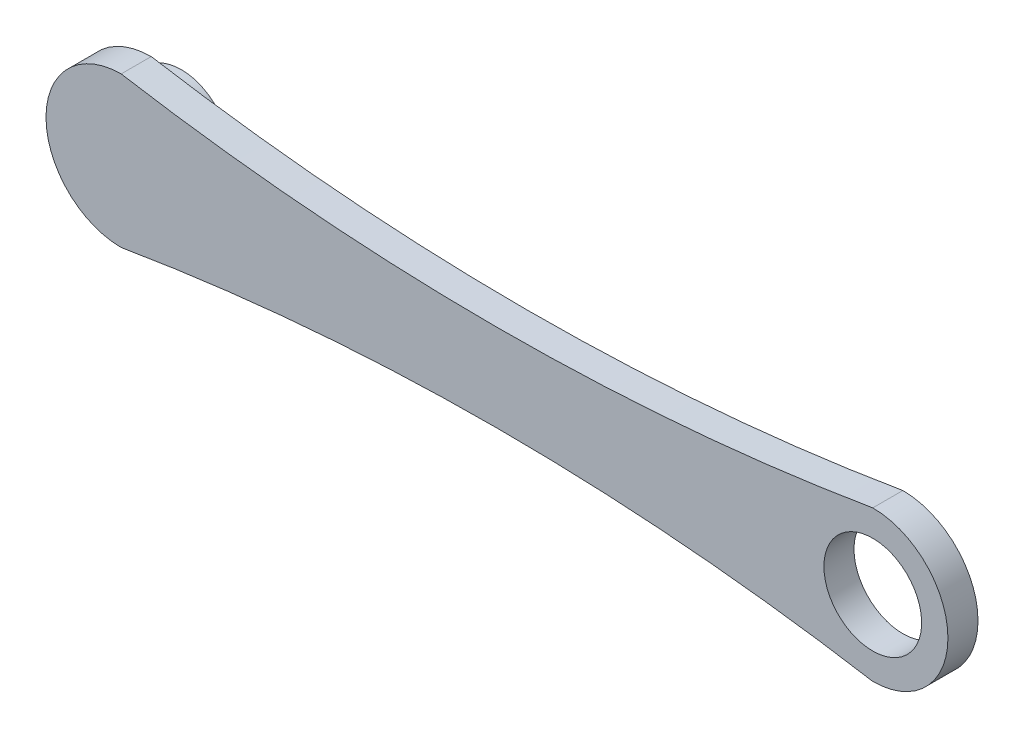
ISO-10303-21;
HEADER;
FILE_DESCRIPTION(('STEP AP214'),'2;1');
FILE_NAME('part.step','',(''),(''),'','','');
FILE_SCHEMA(('AUTOMOTIVE_DESIGN { 1 0 10303 214 1 1 1 1 }'));
ENDSEC;
DATA;
#1=APPLICATION_CONTEXT('core data for automotive mechanical design processes');
#2=APPLICATION_PROTOCOL_DEFINITION('international standard','automotive_design',2000,#1);
#3=PRODUCT_CONTEXT('',#1,'mechanical');
#4=PRODUCT('Part','Part','',(#3));
#5=PRODUCT_RELATED_PRODUCT_CATEGORY('part','',(#4));
#6=PRODUCT_DEFINITION_FORMATION('','',#4);
#7=PRODUCT_DEFINITION_CONTEXT('part definition',#1,'design');
#8=PRODUCT_DEFINITION('design','',#6,#7);
#9=PRODUCT_DEFINITION_SHAPE('','',#8);
#10=(LENGTH_UNIT() NAMED_UNIT(*) SI_UNIT(.MILLI.,.METRE.));
#11=(NAMED_UNIT(*) PLANE_ANGLE_UNIT() SI_UNIT($,.RADIAN.));
#12=(NAMED_UNIT(*) SI_UNIT($,.STERADIAN.) SOLID_ANGLE_UNIT());
#13=UNCERTAINTY_MEASURE_WITH_UNIT(LENGTH_MEASURE(1.E-05),#10,'distance_accuracy_value','');
#14=(GEOMETRIC_REPRESENTATION_CONTEXT(3) GLOBAL_UNCERTAINTY_ASSIGNED_CONTEXT((#13)) GLOBAL_UNIT_ASSIGNED_CONTEXT((#10,
#11,#12)) REPRESENTATION_CONTEXT('',''));
#15=CARTESIAN_POINT('',(0.,0.,0.));
#16=DIRECTION('',(0.,0.,1.));
#17=DIRECTION('',(1.,0.,0.));
#18=AXIS2_PLACEMENT_3D('',#15,#16,#17);
#19=CARTESIAN_POINT('',(0.,764.509972887452,10.));
#20=DIRECTION('',(0.,0.,-1.));
#21=DIRECTION('',(-1.,0.,0.));
#22=AXIS2_PLACEMENT_3D('',#19,#20,#21);
#23=CYLINDRICAL_SURFACE('',#22,750.);
#24=CARTESIAN_POINT('',(0.,764.509972887452,0.));
#25=DIRECTION('',(0.,0.,-1.));
#26=DIRECTION('',(1.,0.,0.));
#27=AXIS2_PLACEMENT_3D('',#24,#25,#26);
#28=CIRCLE('',#27,750.);
#29=CARTESIAN_POINT('',(125.,24.9999999999999,0.));
#30=VERTEX_POINT('',#29);
#31=CARTESIAN_POINT('',(-125.,25.,0.));
#32=VERTEX_POINT('',#31);
#33=EDGE_CURVE('E98',#30,#32,#28,.T.);
#34=ORIENTED_EDGE('',*,*,#33,.T.);
#35=DIRECTION('',(0.,0.,-1.));
#36=VECTOR('',#35,1.);
#37=CARTESIAN_POINT('',(-125.,25.,10.));
#38=LINE('',#37,#36);
#39=CARTESIAN_POINT('',(-125.,25.,10.));
#40=VERTEX_POINT('',#39);
#41=EDGE_CURVE('E40',#40,#32,#38,.T.);
#42=ORIENTED_EDGE('',*,*,#41,.F.);
#43=CARTESIAN_POINT('',(0.,764.509972887452,10.));
#44=DIRECTION('',(0.,0.,-1.));
#45=DIRECTION('',(1.,0.,0.));
#46=AXIS2_PLACEMENT_3D('',#43,#44,#45);
#47=CIRCLE('',#46,750.);
#48=CARTESIAN_POINT('',(125.,24.9999999999999,10.));
#49=VERTEX_POINT('',#48);
#50=EDGE_CURVE('E84',#49,#40,#47,.T.);
#51=ORIENTED_EDGE('',*,*,#50,.F.);
#52=DIRECTION('',(0.,0.,-1.));
#53=VECTOR('',#52,1.);
#54=CARTESIAN_POINT('',(125.,24.9999999999999,10.));
#55=LINE('',#54,#53);
#56=EDGE_CURVE('E94',#49,#30,#55,.T.);
#57=ORIENTED_EDGE('',*,*,#56,.T.);
#58=EDGE_LOOP('',(#34,#42,#51,#57));
#59=FACE_BOUND('',#58,.T.);
#60=ADVANCED_FACE('F32',(#59),#23,.F.);
#61=CARTESIAN_POINT('',(-125.,0.,10.));
#62=DIRECTION('',(0.,0.,-1.));
#63=DIRECTION('',(-1.,0.,0.));
#64=AXIS2_PLACEMENT_3D('',#61,#62,#63);
#65=CYLINDRICAL_SURFACE('',#64,25.);
#66=CARTESIAN_POINT('',(-125.,0.,0.));
#67=DIRECTION('',(0.,0.,1.));
#68=DIRECTION('',(1.,0.,0.));
#69=AXIS2_PLACEMENT_3D('',#66,#67,#68);
#70=CIRCLE('',#69,25.);
#71=CARTESIAN_POINT('',(-125.,-24.9999999999999,0.));
#72=VERTEX_POINT('',#71);
#73=EDGE_CURVE('E89',#32,#72,#70,.T.);
#74=ORIENTED_EDGE('',*,*,#73,.T.);
#75=DIRECTION('',(0.,0.,-1.));
#76=VECTOR('',#75,1.);
#77=CARTESIAN_POINT('',(-125.,-24.9999999999999,10.));
#78=LINE('',#77,#76);
#79=CARTESIAN_POINT('',(-125.,-24.9999999999999,10.));
#80=VERTEX_POINT('',#79);
#81=EDGE_CURVE('E87',#80,#72,#78,.T.);
#82=ORIENTED_EDGE('',*,*,#81,.F.);
#83=CARTESIAN_POINT('',(-125.,0.,10.));
#84=DIRECTION('',(0.,0.,1.));
#85=DIRECTION('',(1.,0.,0.));
#86=AXIS2_PLACEMENT_3D('',#83,#84,#85);
#87=CIRCLE('',#86,25.);
#88=EDGE_CURVE('E79',#40,#80,#87,.T.);
#89=ORIENTED_EDGE('',*,*,#88,.F.);
#90=ORIENTED_EDGE('',*,*,#41,.T.);
#91=EDGE_LOOP('',(#74,#82,#89,#90));
#92=FACE_BOUND('',#91,.T.);
#93=ADVANCED_FACE('F88',(#92),#65,.T.);
#94=CARTESIAN_POINT('',(0.,-764.509972887452,10.));
#95=DIRECTION('',(0.,0.,-1.));
#96=DIRECTION('',(-1.,0.,0.));
#97=AXIS2_PLACEMENT_3D('',#94,#95,#96);
#98=CYLINDRICAL_SURFACE('',#97,750.);
#99=CARTESIAN_POINT('',(0.,-764.509972887452,0.));
#100=DIRECTION('',(0.,0.,-1.));
#101=DIRECTION('',(-1.,0.,0.));
#102=AXIS2_PLACEMENT_3D('',#99,#100,#101);
#103=CIRCLE('',#102,750.);
#104=CARTESIAN_POINT('',(125.,-25.,0.));
#105=VERTEX_POINT('',#104);
#106=EDGE_CURVE('E65',#72,#105,#103,.T.);
#107=ORIENTED_EDGE('',*,*,#106,.T.);
#108=DIRECTION('',(0.,0.,-1.));
#109=VECTOR('',#108,1.);
#110=CARTESIAN_POINT('',(125.,-25.,10.));
#111=LINE('',#110,#109);
#112=CARTESIAN_POINT('',(125.,-25.,10.));
#113=VERTEX_POINT('',#112);
#114=EDGE_CURVE('E90',#113,#105,#111,.T.);
#115=ORIENTED_EDGE('',*,*,#114,.F.);
#116=CARTESIAN_POINT('',(0.,-764.509972887452,10.));
#117=DIRECTION('',(0.,0.,-1.));
#118=DIRECTION('',(-1.,0.,0.));
#119=AXIS2_PLACEMENT_3D('',#116,#117,#118);
#120=CIRCLE('',#119,750.);
#121=EDGE_CURVE('E82',#80,#113,#120,.T.);
#122=ORIENTED_EDGE('',*,*,#121,.F.);
#123=ORIENTED_EDGE('',*,*,#81,.T.);
#124=EDGE_LOOP('',(#107,#115,#122,#123));
#125=FACE_BOUND('',#124,.T.);
#126=ADVANCED_FACE('F92',(#125),#98,.F.);
#127=CARTESIAN_POINT('',(125.,0.,10.));
#128=DIRECTION('',(0.,0.,-1.));
#129=DIRECTION('',(-1.,0.,0.));
#130=AXIS2_PLACEMENT_3D('',#127,#128,#129);
#131=CYLINDRICAL_SURFACE('',#130,25.);
#132=CARTESIAN_POINT('',(125.,0.,0.));
#133=DIRECTION('',(0.,0.,1.));
#134=DIRECTION('',(1.,0.,0.));
#135=AXIS2_PLACEMENT_3D('',#132,#133,#134);
#136=CIRCLE('',#135,25.);
#137=EDGE_CURVE('E71',#105,#30,#136,.T.);
#138=ORIENTED_EDGE('',*,*,#137,.T.);
#139=ORIENTED_EDGE('',*,*,#56,.F.);
#140=CARTESIAN_POINT('',(125.,0.,10.));
#141=DIRECTION('',(0.,0.,1.));
#142=DIRECTION('',(1.,0.,0.));
#143=AXIS2_PLACEMENT_3D('',#140,#141,#142);
#144=CIRCLE('',#143,25.);
#145=EDGE_CURVE('E48',#113,#49,#144,.T.);
#146=ORIENTED_EDGE('',*,*,#145,.F.);
#147=ORIENTED_EDGE('',*,*,#114,.T.);
#148=EDGE_LOOP('',(#138,#139,#146,#147));
#149=FACE_BOUND('',#148,.T.);
#150=ADVANCED_FACE('F121',(#149),#131,.T.);
#151=CARTESIAN_POINT('',(62.5,382.254986443726,10.));
#152=DIRECTION('',(0.,0.,1.));
#153=DIRECTION('',(1.,0.,0.));
#154=AXIS2_PLACEMENT_3D('',#151,#152,#153);
#155=PLANE('',#154);
#156=CARTESIAN_POINT('',(125.,0.,10.));
#157=DIRECTION('',(0.,0.,1.));
#158=DIRECTION('',(-1.,0.,0.));
#159=AXIS2_PLACEMENT_3D('',#156,#157,#158);
#160=CIRCLE('',#159,16.25);
#161=CARTESIAN_POINT('',(108.75,0.,10.));
#162=VERTEX_POINT('',#161);
#163=EDGE_CURVE('E181',#162,#162,#160,.T.);
#164=ORIENTED_EDGE('',*,*,#163,.F.);
#165=EDGE_LOOP('',(#164));
#166=FACE_BOUND('',#165,.T.);
#167=ORIENTED_EDGE('',*,*,#50,.T.);
#168=ORIENTED_EDGE('',*,*,#88,.T.);
#169=ORIENTED_EDGE('',*,*,#121,.T.);
#170=ORIENTED_EDGE('',*,*,#145,.T.);
#171=EDGE_LOOP('',(#167,#168,#169,#170));
#172=FACE_BOUND('',#171,.T.);
#173=ADVANCED_FACE('F80',(#166,#172),#155,.T.);
#174=CARTESIAN_POINT('',(62.5,382.254986443726,0.));
#175=DIRECTION('',(0.,0.,1.));
#176=DIRECTION('',(1.,0.,0.));
#177=AXIS2_PLACEMENT_3D('',#174,#175,#176);
#178=PLANE('',#177);
#179=CARTESIAN_POINT('',(125.,0.,0.));
#180=DIRECTION('',(0.,0.,1.));
#181=DIRECTION('',(-1.,0.,0.));
#182=AXIS2_PLACEMENT_3D('',#179,#180,#181);
#183=CIRCLE('',#182,16.25);
#184=CARTESIAN_POINT('',(108.75,0.,0.));
#185=VERTEX_POINT('',#184);
#186=EDGE_CURVE('E179',#185,#185,#183,.T.);
#187=ORIENTED_EDGE('',*,*,#186,.T.);
#188=EDGE_LOOP('',(#187));
#189=FACE_BOUND('',#188,.T.);
#190=CARTESIAN_POINT('',(-125.,0.,0.));
#191=DIRECTION('',(0.,0.,1.));
#192=DIRECTION('',(1.,0.,0.));
#193=AXIS2_PLACEMENT_3D('',#190,#191,#192);
#194=CIRCLE('',#193,16.25);
#195=CARTESIAN_POINT('',(-108.75,0.,0.));
#196=VERTEX_POINT('',#195);
#197=EDGE_CURVE('E11',#196,#196,#194,.F.);
#198=ORIENTED_EDGE('',*,*,#197,.F.);
#199=EDGE_LOOP('',(#198));
#200=FACE_BOUND('',#199,.T.);
#201=ORIENTED_EDGE('',*,*,#33,.F.);
#202=ORIENTED_EDGE('',*,*,#137,.F.);
#203=ORIENTED_EDGE('',*,*,#106,.F.);
#204=ORIENTED_EDGE('',*,*,#73,.F.);
#205=EDGE_LOOP('',(#201,#202,#203,#204));
#206=FACE_BOUND('',#205,.T.);
#207=ADVANCED_FACE('F109',(#189,#200,#206),#178,.F.);
#208=CARTESIAN_POINT('',(-125.,0.,-10.));
#209=DIRECTION('',(0.,0.,1.));
#210=DIRECTION('',(0.,-1.,0.));
#211=AXIS2_PLACEMENT_3D('',#208,#209,#210);
#212=CYLINDRICAL_SURFACE('',#211,16.25);
#213=CARTESIAN_POINT('',(-125.,0.,-10.));
#214=DIRECTION('',(0.,0.,-1.));
#215=DIRECTION('',(0.,1.,0.));
#216=AXIS2_PLACEMENT_3D('',#213,#214,#215);
#217=CIRCLE('',#216,16.25);
#218=CARTESIAN_POINT('',(-125.,16.25,-10.));
#219=VERTEX_POINT('',#218);
#220=EDGE_CURVE('E101',#219,#219,#217,.T.);
#221=ORIENTED_EDGE('',*,*,#220,.F.);
#222=EDGE_LOOP('',(#221));
#223=FACE_BOUND('',#222,.T.);
#224=ORIENTED_EDGE('',*,*,#197,.T.);
#225=EDGE_LOOP('',(#224));
#226=FACE_BOUND('',#225,.T.);
#227=ADVANCED_FACE('F111',(#223,#226),#212,.T.);
#228=CARTESIAN_POINT('',(-125.,0.,-10.));
#229=DIRECTION('',(0.,0.,-1.));
#230=DIRECTION('',(0.,1.,0.));
#231=AXIS2_PLACEMENT_3D('',#228,#229,#230);
#232=PLANE('',#231);
#233=ORIENTED_EDGE('',*,*,#220,.T.);
#234=EDGE_LOOP('',(#233));
#235=FACE_BOUND('',#234,.T.);
#236=ADVANCED_FACE('F118',(#235),#232,.T.);
#237=CARTESIAN_POINT('',(125.,0.,0.));
#238=DIRECTION('',(0.,0.,1.));
#239=DIRECTION('',(1.,0.,0.));
#240=AXIS2_PLACEMENT_3D('',#237,#238,#239);
#241=CYLINDRICAL_SURFACE('',#240,16.25);
#242=ORIENTED_EDGE('',*,*,#186,.F.);
#243=EDGE_LOOP('',(#242));
#244=FACE_BOUND('',#243,.T.);
#245=ORIENTED_EDGE('',*,*,#163,.T.);
#246=EDGE_LOOP('',(#245));
#247=FACE_BOUND('',#246,.T.);
#248=ADVANCED_FACE('F159',(#244,#247),#241,.F.);
#249=CLOSED_SHELL('',(#60,#93,#126,#150,#173,#207,#227,#236,#248));
#250=MANIFOLD_SOLID_BREP('B2',#249);
#251=ADVANCED_BREP_SHAPE_REPRESENTATION('',(#18,#250),#14);
#252=SHAPE_DEFINITION_REPRESENTATION(#9,#251);
ENDSEC;
END-ISO-10303-21;
